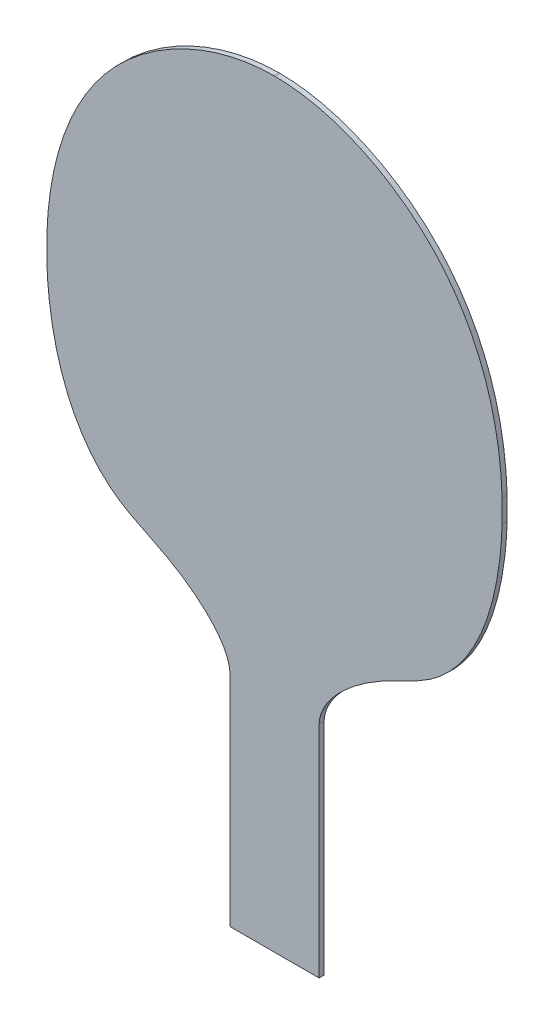
ISO-10303-21;
HEADER;
FILE_DESCRIPTION(('STEP AP214'),'2;1');
FILE_NAME('part.step','',(''),(''),'','','');
FILE_SCHEMA(('AUTOMOTIVE_DESIGN { 1 0 10303 214 1 1 1 1 }'));
ENDSEC;
DATA;
#1=APPLICATION_CONTEXT('core data for automotive mechanical design processes');
#2=APPLICATION_PROTOCOL_DEFINITION('international standard','automotive_design',2000,#1);
#3=PRODUCT_CONTEXT('',#1,'mechanical');
#4=PRODUCT('Part','Part','',(#3));
#5=PRODUCT_RELATED_PRODUCT_CATEGORY('part','',(#4));
#6=PRODUCT_DEFINITION_FORMATION('','',#4);
#7=PRODUCT_DEFINITION_CONTEXT('part definition',#1,'design');
#8=PRODUCT_DEFINITION('design','',#6,#7);
#9=PRODUCT_DEFINITION_SHAPE('','',#8);
#10=(LENGTH_UNIT() NAMED_UNIT(*) SI_UNIT(.MILLI.,.METRE.));
#11=(NAMED_UNIT(*) PLANE_ANGLE_UNIT() SI_UNIT($,.RADIAN.));
#12=(NAMED_UNIT(*) SI_UNIT($,.STERADIAN.) SOLID_ANGLE_UNIT());
#13=UNCERTAINTY_MEASURE_WITH_UNIT(LENGTH_MEASURE(1.E-05),#10,'distance_accuracy_value','');
#14=(GEOMETRIC_REPRESENTATION_CONTEXT(3) GLOBAL_UNCERTAINTY_ASSIGNED_CONTEXT((#13)) GLOBAL_UNIT_ASSIGNED_CONTEXT((#10,
#11,#12)) REPRESENTATION_CONTEXT('',''));
#15=CARTESIAN_POINT('',(0.,0.,0.));
#16=DIRECTION('',(0.,0.,1.));
#17=DIRECTION('',(1.,0.,0.));
#18=AXIS2_PLACEMENT_3D('',#15,#16,#17);
#19=CARTESIAN_POINT('',(107.625262697057,0.,2.));
#20=DIRECTION('',(-1.,0.,0.));
#21=DIRECTION('',(0.,0.,1.));
#22=AXIS2_PLACEMENT_3D('',#19,#20,#21);
#23=PLANE('',#22);
#24=DIRECTION('',(0.,1.,0.));
#25=VECTOR('',#24,1.);
#26=CARTESIAN_POINT('',(107.625262697057,0.,0.));
#27=LINE('',#26,#25);
#28=CARTESIAN_POINT('',(107.625262697057,0.,0.));
#29=VERTEX_POINT('',#28);
#30=CARTESIAN_POINT('',(107.625262697057,86.9998596473512,0.));
#31=VERTEX_POINT('',#30);
#32=EDGE_CURVE('E177',#29,#31,#27,.T.);
#33=ORIENTED_EDGE('',*,*,#32,.T.);
#34=DIRECTION('',(0.,0.,-1.));
#35=VECTOR('',#34,1.);
#36=CARTESIAN_POINT('',(107.625262697057,86.9998596473512,2.));
#37=LINE('',#36,#35);
#38=CARTESIAN_POINT('',(107.625262697057,86.9998596473512,2.));
#39=VERTEX_POINT('',#38);
#40=EDGE_CURVE('E11',#39,#31,#37,.T.);
#41=ORIENTED_EDGE('',*,*,#40,.F.);
#42=DIRECTION('',(0.,1.,0.));
#43=VECTOR('',#42,1.);
#44=CARTESIAN_POINT('',(107.625262697057,0.,2.));
#45=LINE('',#44,#43);
#46=CARTESIAN_POINT('',(107.625262697057,0.,2.));
#47=VERTEX_POINT('',#46);
#48=EDGE_CURVE('E215',#47,#39,#45,.T.);
#49=ORIENTED_EDGE('',*,*,#48,.F.);
#50=DIRECTION('',(0.,0.,-1.));
#51=VECTOR('',#50,1.);
#52=CARTESIAN_POINT('',(107.625262697057,0.,2.));
#53=LINE('',#52,#51);
#54=EDGE_CURVE('E173',#47,#29,#53,.T.);
#55=ORIENTED_EDGE('',*,*,#54,.T.);
#56=EDGE_LOOP('',(#33,#41,#49,#55));
#57=FACE_BOUND('',#56,.T.);
#58=ADVANCED_FACE('F43',(#57),#23,.F.);
#59=CARTESIAN_POINT('',(107.625262697057,86.9998596473512,2.));
#60=CARTESIAN_POINT('',(108.054143271881,95.9780781181096,2.));
#61=CARTESIAN_POINT('',(127.48664385242,113.866261667071,2.));
#62=CARTESIAN_POINT('',(148.895297768302,121.069134620661,2.));
#63=CARTESIAN_POINT('',(172.848320314368,142.893766889073,2.));
#64=CARTESIAN_POINT('',(186.885702417391,200.23626057864,2.));
#65=CARTESIAN_POINT('',(166.175836185028,274.66674408962,2.));
#66=CARTESIAN_POINT('',(113.013518293775,300.040860079915,2.));
#67=CARTESIAN_POINT('',(89.9999999999999,300.,2.));
#68=B_SPLINE_CURVE_WITH_KNOTS('',3,(#59,#60,#61,#62,#63,#64,#65,#66,#67),.UNSPECIFIED.,.F.,.F.,
(4,1,1,1,1,1,4),(0.,0.116860667780754,0.211663242380486,0.246387133981133,0.46409958378722,
0.758218729716948,1.),.UNSPECIFIED.);
#69=DIRECTION('',(0.,0.,-1.));
#70=VECTOR('',#69,1.);
#71=SURFACE_OF_LINEAR_EXTRUSION('',#68,#70);
#72=CARTESIAN_POINT('',(107.625262697057,86.9998596473512,0.));
#73=CARTESIAN_POINT('',(108.054143271881,95.9780781181096,0.));
#74=CARTESIAN_POINT('',(127.48664385242,113.866261667071,0.));
#75=CARTESIAN_POINT('',(148.895297768302,121.069134620661,0.));
#76=CARTESIAN_POINT('',(172.848320314368,142.893766889073,0.));
#77=CARTESIAN_POINT('',(186.885702417391,200.23626057864,0.));
#78=CARTESIAN_POINT('',(166.175836185028,274.66674408962,0.));
#79=CARTESIAN_POINT('',(113.013518293775,300.040860079915,0.));
#80=CARTESIAN_POINT('',(89.9999999999999,300.,0.));
#81=B_SPLINE_CURVE_WITH_KNOTS('',3,(#72,#73,#74,#75,#76,#77,#78,#79,#80),.UNSPECIFIED.,.F.,.F.,
(4,1,1,1,1,1,4),(0.,0.116860667780754,0.211663242380486,0.246387133981133,0.46409958378722,
0.758218729716948,1.),.UNSPECIFIED.);
#82=CARTESIAN_POINT('',(180.,191.650320350045,0.));
#83=VERTEX_POINT('',#82);
#84=EDGE_CURVE('E181',#31,#83,#81,.T.);
#85=ORIENTED_EDGE('',*,*,#84,.T.);
#86=DIRECTION('',(0.,0.,-1.));
#87=VECTOR('',#86,1.);
#88=CARTESIAN_POINT('',(180.,191.650320350045,2.));
#89=LINE('',#88,#87);
#90=CARTESIAN_POINT('',(180.,191.650320350045,2.));
#91=VERTEX_POINT('',#90);
#92=EDGE_CURVE('E52',#91,#83,#89,.T.);
#93=ORIENTED_EDGE('',*,*,#92,.F.);
#94=EDGE_CURVE('E119',#39,#91,#68,.T.);
#95=ORIENTED_EDGE('',*,*,#94,.F.);
#96=ORIENTED_EDGE('',*,*,#40,.T.);
#97=EDGE_LOOP('',(#85,#93,#95,#96));
#98=FACE_BOUND('',#97,.T.);
#99=ADVANCED_FACE('F289',(#98),#71,.F.);
#100=CARTESIAN_POINT('',(180.,0.,2.));
#101=DIRECTION('',(-1.,0.,0.));
#102=DIRECTION('',(0.,0.,1.));
#103=AXIS2_PLACEMENT_3D('',#100,#101,#102);
#104=PLANE('',#103);
#105=DIRECTION('',(0.,1.,0.));
#106=VECTOR('',#105,1.);
#107=CARTESIAN_POINT('',(180.,0.,0.));
#108=LINE('',#107,#106);
#109=CARTESIAN_POINT('',(180.,200.595525294129,0.));
#110=VERTEX_POINT('',#109);
#111=EDGE_CURVE('E186',#83,#110,#108,.T.);
#112=ORIENTED_EDGE('',*,*,#111,.T.);
#113=DIRECTION('',(0.,0.,-1.));
#114=VECTOR('',#113,1.);
#115=CARTESIAN_POINT('',(180.,200.595525294129,2.));
#116=LINE('',#115,#114);
#117=CARTESIAN_POINT('',(180.,200.595525294129,2.));
#118=VERTEX_POINT('',#117);
#119=EDGE_CURVE('E231',#118,#110,#116,.T.);
#120=ORIENTED_EDGE('',*,*,#119,.F.);
#121=DIRECTION('',(0.,1.,0.));
#122=VECTOR('',#121,1.);
#123=CARTESIAN_POINT('',(180.,0.,2.));
#124=LINE('',#123,#122);
#125=EDGE_CURVE('E242',#91,#118,#124,.T.);
#126=ORIENTED_EDGE('',*,*,#125,.F.);
#127=ORIENTED_EDGE('',*,*,#92,.T.);
#128=EDGE_LOOP('',(#112,#120,#126,#127));
#129=FACE_BOUND('',#128,.T.);
#130=ADVANCED_FACE('F240',(#129),#104,.F.);
#131=CARTESIAN_POINT('',(90.2456793186643,300.,0.));
#132=VERTEX_POINT('',#131);
#133=EDGE_CURVE('E187',#110,#132,#81,.T.);
#134=ORIENTED_EDGE('',*,*,#133,.T.);
#135=DIRECTION('',(0.,0.,-1.));
#136=VECTOR('',#135,1.);
#137=CARTESIAN_POINT('',(90.2456793186643,300.,2.));
#138=LINE('',#137,#136);
#139=CARTESIAN_POINT('',(90.2456793186643,300.,2.));
#140=VERTEX_POINT('',#139);
#141=EDGE_CURVE('E228',#140,#132,#138,.T.);
#142=ORIENTED_EDGE('',*,*,#141,.F.);
#143=EDGE_CURVE('E254',#118,#140,#68,.T.);
#144=ORIENTED_EDGE('',*,*,#143,.F.);
#145=ORIENTED_EDGE('',*,*,#119,.T.);
#146=EDGE_LOOP('',(#134,#142,#144,#145));
#147=FACE_BOUND('',#146,.T.);
#148=ADVANCED_FACE('F286',(#147),#71,.F.);
#149=CARTESIAN_POINT('',(0.,300.,2.));
#150=DIRECTION('',(0.,1.,0.));
#151=DIRECTION('',(0.,0.,1.));
#152=AXIS2_PLACEMENT_3D('',#149,#150,#151);
#153=PLANE('',#152);
#154=DIRECTION('',(1.,0.,0.));
#155=VECTOR('',#154,1.);
#156=CARTESIAN_POINT('',(0.,300.,0.));
#157=LINE('',#156,#155);
#158=CARTESIAN_POINT('',(89.7543206813302,300.,0.));
#159=VERTEX_POINT('',#158);
#160=EDGE_CURVE('E193',#159,#132,#157,.T.);
#161=ORIENTED_EDGE('',*,*,#160,.F.);
#162=DIRECTION('',(0.,0.,-1.));
#163=VECTOR('',#162,1.);
#164=CARTESIAN_POINT('',(89.7543206813302,300.,2.));
#165=LINE('',#164,#163);
#166=CARTESIAN_POINT('',(89.7543206813302,300.,2.));
#167=VERTEX_POINT('',#166);
#168=EDGE_CURVE('E225',#167,#159,#165,.T.);
#169=ORIENTED_EDGE('',*,*,#168,.F.);
#170=DIRECTION('',(1.,0.,0.));
#171=VECTOR('',#170,1.);
#172=CARTESIAN_POINT('',(0.,300.,2.));
#173=LINE('',#172,#171);
#174=EDGE_CURVE('E257',#167,#140,#173,.T.);
#175=ORIENTED_EDGE('',*,*,#174,.T.);
#176=ORIENTED_EDGE('',*,*,#141,.T.);
#177=EDGE_LOOP('',(#161,#169,#175,#176));
#178=FACE_BOUND('',#177,.T.);
#179=ADVANCED_FACE('F283',(#178),#153,.T.);
#180=CARTESIAN_POINT('',(72.3747373029428,86.9998596473512,2.));
#181=CARTESIAN_POINT('',(71.945856728119,95.9780781181096,2.));
#182=CARTESIAN_POINT('',(52.5133561475805,113.866261667071,2.));
#183=CARTESIAN_POINT('',(31.1047022316979,121.069134620661,2.));
#184=CARTESIAN_POINT('',(7.15167968563205,142.893766889073,2.));
#185=CARTESIAN_POINT('',(-6.88570241739131,200.23626057864,2.));
#186=CARTESIAN_POINT('',(13.8241638149721,274.66674408962,2.));
#187=CARTESIAN_POINT('',(66.9864817062248,300.040860079915,2.));
#188=CARTESIAN_POINT('',(90.0000000000001,300.,2.));
#189=B_SPLINE_CURVE_WITH_KNOTS('',3,(#180,#181,#182,#183,#184,#185,#186,#187,#188),
.UNSPECIFIED.,.F.,.F.,(4,1,1,1,1,1,4),(0.,0.116860667780754,0.211663242380486,0.246387133981133,
0.46409958378722,0.758218729716948,1.),.UNSPECIFIED.);
#190=DIRECTION('',(0.,0.,-1.));
#191=VECTOR('',#190,1.);
#192=SURFACE_OF_LINEAR_EXTRUSION('',#189,#191);
#193=CARTESIAN_POINT('',(72.3747373029428,86.9998596473512,0.));
#194=CARTESIAN_POINT('',(71.945856728119,95.9780781181096,0.));
#195=CARTESIAN_POINT('',(52.5133561475805,113.866261667071,0.));
#196=CARTESIAN_POINT('',(31.1047022316979,121.069134620661,0.));
#197=CARTESIAN_POINT('',(7.15167968563205,142.893766889073,0.));
#198=CARTESIAN_POINT('',(-6.88570241739131,200.23626057864,0.));
#199=CARTESIAN_POINT('',(13.8241638149721,274.66674408962,0.));
#200=CARTESIAN_POINT('',(66.9864817062248,300.040860079915,0.));
#201=CARTESIAN_POINT('',(90.0000000000001,300.,0.));
#202=B_SPLINE_CURVE_WITH_KNOTS('',3,(#193,#194,#195,#196,#197,#198,#199,#200,#201),
.UNSPECIFIED.,.F.,.F.,(4,1,1,1,1,1,4),(0.,0.116860667780754,0.211663242380486,0.246387133981133,
0.46409958378722,0.758218729716948,1.),.UNSPECIFIED.);
#203=CARTESIAN_POINT('',(0.,200.595525294128,0.));
#204=VERTEX_POINT('',#203);
#205=EDGE_CURVE('E197',#204,#159,#202,.T.);
#206=ORIENTED_EDGE('',*,*,#205,.F.);
#207=DIRECTION('',(0.,0.,-1.));
#208=VECTOR('',#207,1.);
#209=CARTESIAN_POINT('',(0.,200.595525294128,2.));
#210=LINE('',#209,#208);
#211=CARTESIAN_POINT('',(0.,200.595525294128,2.));
#212=VERTEX_POINT('',#211);
#213=EDGE_CURVE('E222',#212,#204,#210,.T.);
#214=ORIENTED_EDGE('',*,*,#213,.F.);
#215=EDGE_CURVE('E167',#212,#167,#189,.T.);
#216=ORIENTED_EDGE('',*,*,#215,.T.);
#217=ORIENTED_EDGE('',*,*,#168,.T.);
#218=EDGE_LOOP('',(#206,#214,#216,#217));
#219=FACE_BOUND('',#218,.T.);
#220=ADVANCED_FACE('F278',(#219),#192,.T.);
#221=CARTESIAN_POINT('',(0.,0.,2.));
#222=DIRECTION('',(-1.,0.,0.));
#223=DIRECTION('',(0.,0.,1.));
#224=AXIS2_PLACEMENT_3D('',#221,#222,#223);
#225=PLANE('',#224);
#226=DIRECTION('',(0.,1.,0.));
#227=VECTOR('',#226,1.);
#228=CARTESIAN_POINT('',(0.,0.,0.));
#229=LINE('',#228,#227);
#230=CARTESIAN_POINT('',(0.,191.650320350044,0.));
#231=VERTEX_POINT('',#230);
#232=EDGE_CURVE('E203',#231,#204,#229,.T.);
#233=ORIENTED_EDGE('',*,*,#232,.F.);
#234=DIRECTION('',(0.,0.,-1.));
#235=VECTOR('',#234,1.);
#236=CARTESIAN_POINT('',(0.,191.650320350044,2.));
#237=LINE('',#236,#235);
#238=CARTESIAN_POINT('',(0.,191.650320350044,2.));
#239=VERTEX_POINT('',#238);
#240=EDGE_CURVE('E157',#239,#231,#237,.T.);
#241=ORIENTED_EDGE('',*,*,#240,.F.);
#242=DIRECTION('',(0.,1.,0.));
#243=VECTOR('',#242,1.);
#244=CARTESIAN_POINT('',(0.,0.,2.));
#245=LINE('',#244,#243);
#246=EDGE_CURVE('E164',#239,#212,#245,.T.);
#247=ORIENTED_EDGE('',*,*,#246,.T.);
#248=ORIENTED_EDGE('',*,*,#213,.T.);
#249=EDGE_LOOP('',(#233,#241,#247,#248));
#250=FACE_BOUND('',#249,.T.);
#251=ADVANCED_FACE('F277',(#250),#225,.T.);
#252=CARTESIAN_POINT('',(72.3747373029428,86.9998596473512,0.));
#253=VERTEX_POINT('',#252);
#254=EDGE_CURVE('E151',#253,#231,#202,.T.);
#255=ORIENTED_EDGE('',*,*,#254,.F.);
#256=DIRECTION('',(0.,0.,-1.));
#257=VECTOR('',#256,1.);
#258=CARTESIAN_POINT('',(72.3747373029428,86.9998596473512,2.));
#259=LINE('',#258,#257);
#260=CARTESIAN_POINT('',(72.3747373029428,86.9998596473512,2.));
#261=VERTEX_POINT('',#260);
#262=EDGE_CURVE('E146',#261,#253,#259,.T.);
#263=ORIENTED_EDGE('',*,*,#262,.F.);
#264=EDGE_CURVE('E149',#261,#239,#189,.T.);
#265=ORIENTED_EDGE('',*,*,#264,.T.);
#266=ORIENTED_EDGE('',*,*,#240,.T.);
#267=EDGE_LOOP('',(#255,#263,#265,#266));
#268=FACE_BOUND('',#267,.T.);
#269=ADVANCED_FACE('F148',(#268),#192,.T.);
#270=CARTESIAN_POINT('',(72.3747373029428,0.,2.));
#271=DIRECTION('',(-1.,0.,0.));
#272=DIRECTION('',(0.,0.,1.));
#273=AXIS2_PLACEMENT_3D('',#270,#271,#272);
#274=PLANE('',#273);
#275=DIRECTION('',(0.,1.,0.));
#276=VECTOR('',#275,1.);
#277=CARTESIAN_POINT('',(72.3747373029428,0.,0.));
#278=LINE('',#277,#276);
#279=CARTESIAN_POINT('',(72.3747373029428,0.,0.));
#280=VERTEX_POINT('',#279);
#281=EDGE_CURVE('E210',#280,#253,#278,.T.);
#282=ORIENTED_EDGE('',*,*,#281,.F.);
#283=DIRECTION('',(0.,0.,-1.));
#284=VECTOR('',#283,1.);
#285=CARTESIAN_POINT('',(72.3747373029428,0.,2.));
#286=LINE('',#285,#284);
#287=CARTESIAN_POINT('',(72.3747373029428,0.,2.));
#288=VERTEX_POINT('',#287);
#289=EDGE_CURVE('E107',#288,#280,#286,.T.);
#290=ORIENTED_EDGE('',*,*,#289,.F.);
#291=DIRECTION('',(0.,1.,0.));
#292=VECTOR('',#291,1.);
#293=CARTESIAN_POINT('',(72.3747373029428,0.,2.));
#294=LINE('',#293,#292);
#295=EDGE_CURVE('E161',#288,#261,#294,.T.);
#296=ORIENTED_EDGE('',*,*,#295,.T.);
#297=ORIENTED_EDGE('',*,*,#262,.T.);
#298=EDGE_LOOP('',(#282,#290,#296,#297));
#299=FACE_BOUND('',#298,.T.);
#300=ADVANCED_FACE('F168',(#299),#274,.T.);
#301=CARTESIAN_POINT('',(0.,0.,2.));
#302=DIRECTION('',(0.,1.,0.));
#303=DIRECTION('',(0.,0.,1.));
#304=AXIS2_PLACEMENT_3D('',#301,#302,#303);
#305=PLANE('',#304);
#306=DIRECTION('',(1.,0.,0.));
#307=VECTOR('',#306,1.);
#308=CARTESIAN_POINT('',(0.,0.,0.));
#309=LINE('',#308,#307);
#310=EDGE_CURVE('E110',#280,#29,#309,.T.);
#311=ORIENTED_EDGE('',*,*,#310,.T.);
#312=ORIENTED_EDGE('',*,*,#54,.F.);
#313=DIRECTION('',(1.,0.,0.));
#314=VECTOR('',#313,1.);
#315=CARTESIAN_POINT('',(0.,0.,2.));
#316=LINE('',#315,#314);
#317=EDGE_CURVE('E63',#288,#47,#316,.T.);
#318=ORIENTED_EDGE('',*,*,#317,.F.);
#319=ORIENTED_EDGE('',*,*,#289,.T.);
#320=EDGE_LOOP('',(#311,#312,#318,#319));
#321=FACE_BOUND('',#320,.T.);
#322=ADVANCED_FACE('F325',(#321),#305,.F.);
#323=CARTESIAN_POINT('',(0.,0.,2.));
#324=DIRECTION('',(0.,0.,1.));
#325=DIRECTION('',(1.,0.,0.));
#326=AXIS2_PLACEMENT_3D('',#323,#324,#325);
#327=PLANE('',#326);
#328=ORIENTED_EDGE('',*,*,#48,.T.);
#329=ORIENTED_EDGE('',*,*,#94,.T.);
#330=ORIENTED_EDGE('',*,*,#125,.T.);
#331=ORIENTED_EDGE('',*,*,#143,.T.);
#332=ORIENTED_EDGE('',*,*,#174,.F.);
#333=ORIENTED_EDGE('',*,*,#215,.F.);
#334=ORIENTED_EDGE('',*,*,#246,.F.);
#335=ORIENTED_EDGE('',*,*,#264,.F.);
#336=ORIENTED_EDGE('',*,*,#295,.F.);
#337=ORIENTED_EDGE('',*,*,#317,.T.);
#338=EDGE_LOOP('',(#328,#329,#330,#331,#332,#333,#334,#335,#336,#337));
#339=FACE_BOUND('',#338,.T.);
#340=ADVANCED_FACE('F160',(#339),#327,.T.);
#341=CARTESIAN_POINT('',(0.,0.,0.));
#342=DIRECTION('',(0.,0.,1.));
#343=DIRECTION('',(1.,0.,0.));
#344=AXIS2_PLACEMENT_3D('',#341,#342,#343);
#345=PLANE('',#344);
#346=ORIENTED_EDGE('',*,*,#32,.F.);
#347=ORIENTED_EDGE('',*,*,#310,.F.);
#348=ORIENTED_EDGE('',*,*,#281,.T.);
#349=ORIENTED_EDGE('',*,*,#254,.T.);
#350=ORIENTED_EDGE('',*,*,#232,.T.);
#351=ORIENTED_EDGE('',*,*,#205,.T.);
#352=ORIENTED_EDGE('',*,*,#160,.T.);
#353=ORIENTED_EDGE('',*,*,#133,.F.);
#354=ORIENTED_EDGE('',*,*,#111,.F.);
#355=ORIENTED_EDGE('',*,*,#84,.F.);
#356=EDGE_LOOP('',(#346,#347,#348,#349,#350,#351,#352,#353,#354,#355));
#357=FACE_BOUND('',#356,.T.);
#358=ADVANCED_FACE('F246',(#357),#345,.F.);
#359=CLOSED_SHELL('',(#58,#99,#130,#148,#179,#220,#251,#269,#300,#322,#340,#358));
#360=MANIFOLD_SOLID_BREP('B2',#359);
#361=ADVANCED_BREP_SHAPE_REPRESENTATION('',(#18,#360),#14);
#362=SHAPE_DEFINITION_REPRESENTATION(#9,#361);
ENDSEC;
END-ISO-10303-21;
